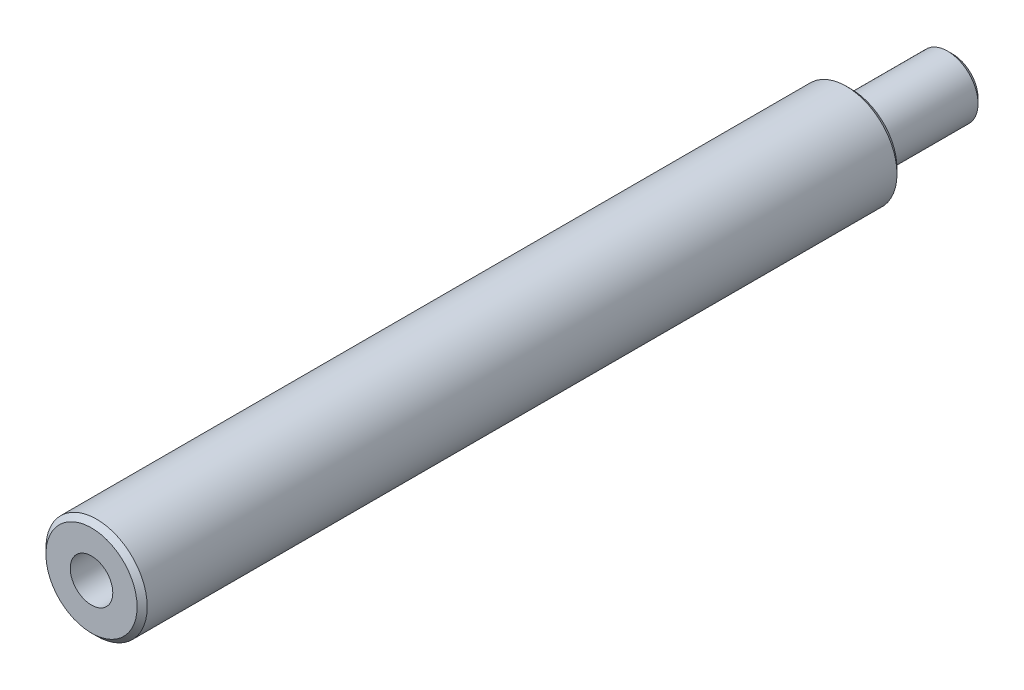
ISO-10303-21;
HEADER;
FILE_DESCRIPTION(('STEP AP214'),'2;1');
FILE_NAME('part.step','',(''),(''),'','','');
FILE_SCHEMA(('AUTOMOTIVE_DESIGN { 1 0 10303 214 1 1 1 1 }'));
ENDSEC;
DATA;
#1=APPLICATION_CONTEXT('core data for automotive mechanical design processes');
#2=APPLICATION_PROTOCOL_DEFINITION('international standard','automotive_design',2000,#1);
#3=PRODUCT_CONTEXT('',#1,'mechanical');
#4=PRODUCT('Part','Part','',(#3));
#5=PRODUCT_RELATED_PRODUCT_CATEGORY('part','',(#4));
#6=PRODUCT_DEFINITION_FORMATION('','',#4);
#7=PRODUCT_DEFINITION_CONTEXT('part definition',#1,'design');
#8=PRODUCT_DEFINITION('design','',#6,#7);
#9=PRODUCT_DEFINITION_SHAPE('','',#8);
#10=(LENGTH_UNIT() NAMED_UNIT(*) SI_UNIT(.MILLI.,.METRE.));
#11=(NAMED_UNIT(*) PLANE_ANGLE_UNIT() SI_UNIT($,.RADIAN.));
#12=(NAMED_UNIT(*) SI_UNIT($,.STERADIAN.) SOLID_ANGLE_UNIT());
#13=UNCERTAINTY_MEASURE_WITH_UNIT(LENGTH_MEASURE(1.E-05),#10,'distance_accuracy_value','');
#14=(GEOMETRIC_REPRESENTATION_CONTEXT(3) GLOBAL_UNCERTAINTY_ASSIGNED_CONTEXT((#13)) GLOBAL_UNIT_ASSIGNED_CONTEXT((#10,
#11,#12)) REPRESENTATION_CONTEXT('',''));
#15=CARTESIAN_POINT('',(0.,0.,0.));
#16=DIRECTION('',(0.,0.,1.));
#17=DIRECTION('',(1.,0.,0.));
#18=AXIS2_PLACEMENT_3D('',#15,#16,#17);
#19=CARTESIAN_POINT('',(0.,0.,75.));
#20=DIRECTION('',(0.,0.,-1.));
#21=DIRECTION('',(-1.,0.,0.));
#22=AXIS2_PLACEMENT_3D('',#19,#20,#21);
#23=CYLINDRICAL_SURFACE('',#22,5.);
#24=CARTESIAN_POINT('',(0.,0.,0.499999999999987));
#25=DIRECTION('',(0.,0.,1.));
#26=DIRECTION('',(1.,0.,0.));
#27=AXIS2_PLACEMENT_3D('',#24,#25,#26);
#28=CIRCLE('',#27,5.);
#29=CARTESIAN_POINT('',(5.,0.,0.499999999999987));
#30=VERTEX_POINT('',#29);
#31=EDGE_CURVE('E74',#30,#30,#28,.T.);
#32=ORIENTED_EDGE('',*,*,#31,.T.);
#33=EDGE_LOOP('',(#32));
#34=FACE_BOUND('',#33,.T.);
#35=CARTESIAN_POINT('',(0.,0.,74.5));
#36=DIRECTION('',(0.,0.,1.));
#37=DIRECTION('',(1.,0.,0.));
#38=AXIS2_PLACEMENT_3D('',#35,#36,#37);
#39=CIRCLE('',#38,5.);
#40=CARTESIAN_POINT('',(5.,0.,74.5));
#41=VERTEX_POINT('',#40);
#42=EDGE_CURVE('E71',#41,#41,#39,.F.);
#43=ORIENTED_EDGE('',*,*,#42,.T.);
#44=EDGE_LOOP('',(#43));
#45=FACE_BOUND('',#44,.T.);
#46=ADVANCED_FACE('F37',(#34,#45),#23,.T.);
#47=CARTESIAN_POINT('',(0.,0.,75.));
#48=DIRECTION('',(0.,0.,1.));
#49=DIRECTION('',(1.,0.,0.));
#50=AXIS2_PLACEMENT_3D('',#47,#48,#49);
#51=PLANE('',#50);
#52=CARTESIAN_POINT('',(0.,0.,75.));
#53=DIRECTION('',(0.,0.,1.));
#54=DIRECTION('',(1.,0.,0.));
#55=AXIS2_PLACEMENT_3D('',#52,#53,#54);
#56=CIRCLE('',#55,4.5);
#57=CARTESIAN_POINT('',(4.5,0.,75.));
#58=VERTEX_POINT('',#57);
#59=EDGE_CURVE('E11',#58,#58,#56,.T.);
#60=ORIENTED_EDGE('',*,*,#59,.T.);
#61=EDGE_LOOP('',(#60));
#62=FACE_BOUND('',#61,.T.);
#63=CARTESIAN_POINT('',(0.,0.,75.));
#64=DIRECTION('',(0.,0.,1.));
#65=DIRECTION('',(1.,0.,0.));
#66=AXIS2_PLACEMENT_3D('',#63,#64,#65);
#67=CIRCLE('',#66,2.1);
#68=CARTESIAN_POINT('',(2.1,0.,75.));
#69=VERTEX_POINT('',#68);
#70=EDGE_CURVE('E58',#69,#69,#67,.T.);
#71=ORIENTED_EDGE('',*,*,#70,.F.);
#72=EDGE_LOOP('',(#71));
#73=FACE_BOUND('',#72,.T.);
#74=ADVANCED_FACE('F90',(#62,#73),#51,.T.);
#75=CARTESIAN_POINT('',(0.,0.,0.));
#76=DIRECTION('',(0.,0.,1.));
#77=DIRECTION('',(1.,0.,0.));
#78=AXIS2_PLACEMENT_3D('',#75,#76,#77);
#79=PLANE('',#78);
#80=CARTESIAN_POINT('',(0.,0.,0.));
#81=DIRECTION('',(0.,0.,1.));
#82=DIRECTION('',(1.,0.,0.));
#83=AXIS2_PLACEMENT_3D('',#80,#81,#82);
#84=CIRCLE('',#83,4.50000000000001);
#85=CARTESIAN_POINT('',(4.50000000000001,0.,0.));
#86=VERTEX_POINT('',#85);
#87=EDGE_CURVE('E44',#86,#86,#84,.F.);
#88=ORIENTED_EDGE('',*,*,#87,.T.);
#89=EDGE_LOOP('',(#88));
#90=FACE_BOUND('',#89,.T.);
#91=CARTESIAN_POINT('',(0.,0.,0.));
#92=DIRECTION('',(0.,0.,-1.));
#93=DIRECTION('',(-1.,0.,0.));
#94=AXIS2_PLACEMENT_3D('',#91,#92,#93);
#95=CIRCLE('',#94,3.);
#96=CARTESIAN_POINT('',(-3.,0.,0.));
#97=VERTEX_POINT('',#96);
#98=EDGE_CURVE('E57',#97,#97,#95,.T.);
#99=ORIENTED_EDGE('',*,*,#98,.F.);
#100=EDGE_LOOP('',(#99));
#101=FACE_BOUND('',#100,.T.);
#102=ADVANCED_FACE('F79',(#90,#101),#79,.F.);
#103=CARTESIAN_POINT('',(0.,0.,-10.));
#104=DIRECTION('',(0.,0.,1.));
#105=DIRECTION('',(1.,0.,0.));
#106=AXIS2_PLACEMENT_3D('',#103,#104,#105);
#107=CYLINDRICAL_SURFACE('',#106,3.);
#108=CARTESIAN_POINT('',(0.,0.,-9.49999999999998));
#109=DIRECTION('',(0.,0.,-1.));
#110=DIRECTION('',(-1.,0.,0.));
#111=AXIS2_PLACEMENT_3D('',#108,#109,#110);
#112=CIRCLE('',#111,3.);
#113=CARTESIAN_POINT('',(-3.,0.,-9.49999999999998));
#114=VERTEX_POINT('',#113);
#115=EDGE_CURVE('E68',#114,#114,#112,.F.);
#116=ORIENTED_EDGE('',*,*,#115,.T.);
#117=EDGE_LOOP('',(#116));
#118=FACE_BOUND('',#117,.T.);
#119=ORIENTED_EDGE('',*,*,#98,.T.);
#120=EDGE_LOOP('',(#119));
#121=FACE_BOUND('',#120,.T.);
#122=ADVANCED_FACE('F113',(#118,#121),#107,.T.);
#123=CARTESIAN_POINT('',(0.,0.,-10.));
#124=DIRECTION('',(0.,0.,-1.));
#125=DIRECTION('',(-1.,0.,0.));
#126=AXIS2_PLACEMENT_3D('',#123,#124,#125);
#127=PLANE('',#126);
#128=CARTESIAN_POINT('',(0.,0.,-10.));
#129=DIRECTION('',(0.,0.,-1.));
#130=DIRECTION('',(-1.,0.,0.));
#131=AXIS2_PLACEMENT_3D('',#128,#129,#130);
#132=CIRCLE('',#131,2.49999999999998);
#133=CARTESIAN_POINT('',(-2.49999999999998,0.,-10.));
#134=VERTEX_POINT('',#133);
#135=EDGE_CURVE('E61',#134,#134,#132,.T.);
#136=ORIENTED_EDGE('',*,*,#135,.T.);
#137=EDGE_LOOP('',(#136));
#138=FACE_BOUND('',#137,.T.);
#139=ADVANCED_FACE('F51',(#138),#127,.T.);
#140=CARTESIAN_POINT('',(0.,0.,65.));
#141=DIRECTION('',(0.,0.,1.));
#142=DIRECTION('',(1.,0.,0.));
#143=AXIS2_PLACEMENT_3D('',#140,#141,#142);
#144=CONICAL_SURFACE('',#143,2.1,1.02974425867665);
#145=CARTESIAN_POINT('',(0.,0.,63.7381927000421));
#146=VERTEX_POINT('',#145);
#147=VERTEX_LOOP('',#146);
#148=FACE_BOUND('',#147,.T.);
#149=CARTESIAN_POINT('',(0.,0.,65.));
#150=DIRECTION('',(0.,0.,1.));
#151=DIRECTION('',(1.,0.,0.));
#152=AXIS2_PLACEMENT_3D('',#149,#150,#151);
#153=CIRCLE('',#152,2.1);
#154=CARTESIAN_POINT('',(2.1,0.,65.));
#155=VERTEX_POINT('',#154);
#156=EDGE_CURVE('E55',#155,#155,#153,.T.);
#157=ORIENTED_EDGE('',*,*,#156,.T.);
#158=EDGE_LOOP('',(#157));
#159=FACE_BOUND('',#158,.T.);
#160=ADVANCED_FACE('F47',(#148,#159),#144,.F.);
#161=CARTESIAN_POINT('',(0.,0.,75.));
#162=DIRECTION('',(0.,0.,1.));
#163=DIRECTION('',(1.,0.,0.));
#164=AXIS2_PLACEMENT_3D('',#161,#162,#163);
#165=CYLINDRICAL_SURFACE('',#164,2.1);
#166=ORIENTED_EDGE('',*,*,#156,.F.);
#167=EDGE_LOOP('',(#166));
#168=FACE_BOUND('',#167,.T.);
#169=ORIENTED_EDGE('',*,*,#70,.T.);
#170=EDGE_LOOP('',(#169));
#171=FACE_BOUND('',#170,.T.);
#172=ADVANCED_FACE('F50',(#168,#171),#165,.F.);
#173=CARTESIAN_POINT('',(0.,0.,-10.));
#174=DIRECTION('',(0.,0.,1.));
#175=DIRECTION('',(1.,0.,0.));
#176=AXIS2_PLACEMENT_3D('',#173,#174,#175);
#177=CONICAL_SURFACE('',#176,2.49999999999998,0.785398163397451);
#178=ORIENTED_EDGE('',*,*,#115,.F.);
#179=EDGE_LOOP('',(#178));
#180=FACE_BOUND('',#179,.T.);
#181=ORIENTED_EDGE('',*,*,#135,.F.);
#182=EDGE_LOOP('',(#181));
#183=FACE_BOUND('',#182,.T.);
#184=ADVANCED_FACE('F85',(#180,#183),#177,.T.);
#185=CARTESIAN_POINT('',(0.,0.,0.499999999999987));
#186=DIRECTION('',(0.,0.,1.));
#187=DIRECTION('',(1.,0.,0.));
#188=AXIS2_PLACEMENT_3D('',#185,#186,#187);
#189=CONICAL_SURFACE('',#188,5.,0.785398163397451);
#190=ORIENTED_EDGE('',*,*,#87,.F.);
#191=EDGE_LOOP('',(#190));
#192=FACE_BOUND('',#191,.T.);
#193=ORIENTED_EDGE('',*,*,#31,.F.);
#194=EDGE_LOOP('',(#193));
#195=FACE_BOUND('',#194,.T.);
#196=ADVANCED_FACE('F82',(#192,#195),#189,.T.);
#197=CARTESIAN_POINT('',(0.,0.,75.));
#198=DIRECTION('',(0.,0.,-1.));
#199=DIRECTION('',(-1.,0.,0.));
#200=AXIS2_PLACEMENT_3D('',#197,#198,#199);
#201=CONICAL_SURFACE('',#200,4.5,0.785398163397444);
#202=ORIENTED_EDGE('',*,*,#42,.F.);
#203=EDGE_LOOP('',(#202));
#204=FACE_BOUND('',#203,.T.);
#205=ORIENTED_EDGE('',*,*,#59,.F.);
#206=EDGE_LOOP('',(#205));
#207=FACE_BOUND('',#206,.T.);
#208=ADVANCED_FACE('F39',(#204,#207),#201,.T.);
#209=CLOSED_SHELL('',(#46,#74,#102,#122,#139,#160,#172,#184,#196,#208));
#210=MANIFOLD_SOLID_BREP('B2',#209);
#211=ADVANCED_BREP_SHAPE_REPRESENTATION('',(#18,#210),#14);
#212=SHAPE_DEFINITION_REPRESENTATION(#9,#211);
ENDSEC;
END-ISO-10303-21;
